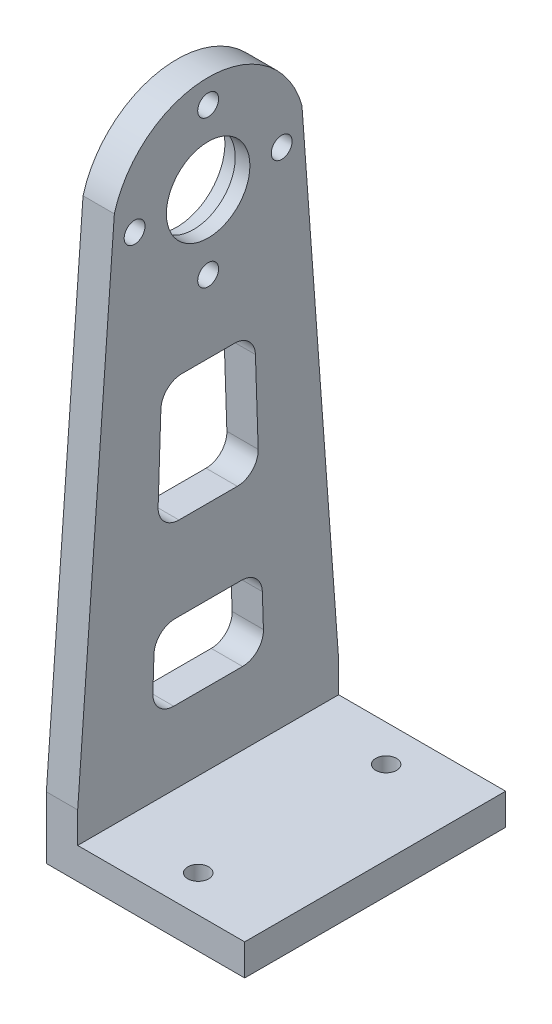
ISO-10303-21;
HEADER;
FILE_DESCRIPTION(('STEP AP214'),'2;1');
FILE_NAME('part.step','',(''),(''),'','','');
FILE_SCHEMA(('AUTOMOTIVE_DESIGN { 1 0 10303 214 1 1 1 1 }'));
ENDSEC;
DATA;
#1=APPLICATION_CONTEXT('core data for automotive mechanical design processes');
#2=APPLICATION_PROTOCOL_DEFINITION('international standard','automotive_design',2000,#1);
#3=PRODUCT_CONTEXT('',#1,'mechanical');
#4=PRODUCT('Part','Part','',(#3));
#5=PRODUCT_RELATED_PRODUCT_CATEGORY('part','',(#4));
#6=PRODUCT_DEFINITION_FORMATION('','',#4);
#7=PRODUCT_DEFINITION_CONTEXT('part definition',#1,'design');
#8=PRODUCT_DEFINITION('design','',#6,#7);
#9=PRODUCT_DEFINITION_SHAPE('','',#8);
#10=(LENGTH_UNIT() NAMED_UNIT(*) SI_UNIT(.MILLI.,.METRE.));
#11=(NAMED_UNIT(*) PLANE_ANGLE_UNIT() SI_UNIT($,.RADIAN.));
#12=(NAMED_UNIT(*) SI_UNIT($,.STERADIAN.) SOLID_ANGLE_UNIT());
#13=UNCERTAINTY_MEASURE_WITH_UNIT(LENGTH_MEASURE(1.E-05),#10,'distance_accuracy_value','');
#14=(GEOMETRIC_REPRESENTATION_CONTEXT(3) GLOBAL_UNCERTAINTY_ASSIGNED_CONTEXT((#13)) GLOBAL_UNIT_ASSIGNED_CONTEXT((#10,
#11,#12)) REPRESENTATION_CONTEXT('',''));
#15=CARTESIAN_POINT('',(0.,0.,0.));
#16=DIRECTION('',(0.,0.,1.));
#17=DIRECTION('',(1.,0.,0.));
#18=AXIS2_PLACEMENT_3D('',#15,#16,#17);
#19=CARTESIAN_POINT('',(15.5,-52.,0.));
#20=DIRECTION('',(-1.,0.,0.));
#21=DIRECTION('',(0.,0.,1.));
#22=AXIS2_PLACEMENT_3D('',#19,#20,#21);
#23=CYLINDRICAL_SURFACE('',#22,4.);
#24=CARTESIAN_POINT('',(16.5,-52.,0.));
#25=DIRECTION('',(-1.,0.,0.));
#26=DIRECTION('',(0.,0.,-1.));
#27=AXIS2_PLACEMENT_3D('',#24,#25,#26);
#28=CIRCLE('',#27,4.);
#29=CARTESIAN_POINT('',(16.5,-52.,-4.));
#30=VERTEX_POINT('',#29);
#31=EDGE_CURVE('E47',#30,#30,#28,.T.);
#32=ORIENTED_EDGE('',*,*,#31,.F.);
#33=EDGE_LOOP('',(#32));
#34=FACE_BOUND('',#33,.T.);
#35=CARTESIAN_POINT('',(15.1,-52.,0.));
#36=DIRECTION('',(-1.,0.,0.));
#37=DIRECTION('',(0.,0.,1.));
#38=AXIS2_PLACEMENT_3D('',#35,#36,#37);
#39=CIRCLE('',#38,4.);
#40=CARTESIAN_POINT('',(15.1,-52.,4.));
#41=VERTEX_POINT('',#40);
#42=EDGE_CURVE('E41',#41,#41,#39,.F.);
#43=ORIENTED_EDGE('',*,*,#42,.F.);
#44=EDGE_LOOP('',(#43));
#45=FACE_BOUND('',#44,.T.);
#46=ADVANCED_FACE('F38',(#34,#45),#23,.F.);
#47=CARTESIAN_POINT('',(16.5,-100.7,-12.5));
#48=DIRECTION('',(1.,0.,0.));
#49=DIRECTION('',(0.,-1.,0.));
#50=AXIS2_PLACEMENT_3D('',#47,#48,#49);
#51=PLANE('',#50);
#52=CARTESIAN_POINT('',(16.5,-59.0452123011725,1.54223501579341E-13));
#53=DIRECTION('',(-1.,0.,0.));
#54=DIRECTION('',(0.,0.,1.));
#55=AXIS2_PLACEMENT_3D('',#52,#53,#54);
#56=CIRCLE('',#55,1.);
#57=CARTESIAN_POINT('',(16.5,-59.0452123011725,1.00000000000015));
#58=VERTEX_POINT('',#57);
#59=EDGE_CURVE('E520',#58,#58,#56,.T.);
#60=ORIENTED_EDGE('',*,*,#59,.T.);
#61=EDGE_LOOP('',(#60));
#62=FACE_BOUND('',#61,.T.);
#63=CARTESIAN_POINT('',(16.5,-52.,7.04521230117253));
#64=DIRECTION('',(-1.,0.,0.));
#65=DIRECTION('',(0.,0.,1.));
#66=AXIS2_PLACEMENT_3D('',#63,#64,#65);
#67=CIRCLE('',#66,1.00000000000001);
#68=CARTESIAN_POINT('',(16.5,-52.,8.04521230117253));
#69=VERTEX_POINT('',#68);
#70=EDGE_CURVE('E526',#69,#69,#67,.T.);
#71=ORIENTED_EDGE('',*,*,#70,.T.);
#72=EDGE_LOOP('',(#71));
#73=FACE_BOUND('',#72,.T.);
#74=CARTESIAN_POINT('',(16.5,-52.0000000000001,-7.04521230117231));
#75=DIRECTION('',(-1.,0.,0.));
#76=DIRECTION('',(0.,0.,1.));
#77=AXIS2_PLACEMENT_3D('',#74,#75,#76);
#78=CIRCLE('',#77,1.);
#79=CARTESIAN_POINT('',(16.5,-52.0000000000001,-6.04521230117231));
#80=VERTEX_POINT('',#79);
#81=EDGE_CURVE('E532',#80,#80,#78,.T.);
#82=ORIENTED_EDGE('',*,*,#81,.T.);
#83=EDGE_LOOP('',(#82));
#84=FACE_BOUND('',#83,.T.);
#85=CARTESIAN_POINT('',(16.5,-44.9547876988277,0.));
#86=DIRECTION('',(-1.,0.,0.));
#87=DIRECTION('',(0.,0.,1.));
#88=AXIS2_PLACEMENT_3D('',#85,#86,#87);
#89=CIRCLE('',#88,1.);
#90=CARTESIAN_POINT('',(16.5,-44.9547876988277,1.00000000000001));
#91=VERTEX_POINT('',#90);
#92=EDGE_CURVE('E197',#91,#91,#89,.T.);
#93=ORIENTED_EDGE('',*,*,#92,.T.);
#94=EDGE_LOOP('',(#93));
#95=FACE_BOUND('',#94,.T.);
#96=DIRECTION('',(0.,-0.997297605701587,-0.0734675823876265));
#97=VECTOR('',#96,1.);
#98=CARTESIAN_POINT('',(16.5,-100.681108800183,-12.7564416540415));
#99=LINE('',#98,#97);
#100=CARTESIAN_POINT('',(16.5,-49.5,-8.986100377806));
#101=VERTEX_POINT('',#100);
#102=CARTESIAN_POINT('',(16.5,-97.2,-12.5));
#103=VERTEX_POINT('',#102);
#104=EDGE_CURVE('E172',#101,#103,#99,.T.);
#105=ORIENTED_EDGE('',*,*,#104,.F.);
#106=CARTESIAN_POINT('',(16.5,-52.0000000000001,0.));
#107=DIRECTION('',(1.,0.,0.));
#108=DIRECTION('',(0.,0.,-1.));
#109=AXIS2_PLACEMENT_3D('',#106,#107,#108);
#110=CIRCLE('',#109,9.32737905308911);
#111=CARTESIAN_POINT('',(16.5,-49.5,8.986100377806));
#112=VERTEX_POINT('',#111);
#113=EDGE_CURVE('E187',#101,#112,#110,.T.);
#114=ORIENTED_EDGE('',*,*,#113,.T.);
#115=DIRECTION('',(0.,0.997297605701587,-0.0734675823876265));
#116=VECTOR('',#115,1.);
#117=CARTESIAN_POINT('',(16.5,-98.8493826998868,12.6215045124945));
#118=LINE('',#117,#116);
#119=CARTESIAN_POINT('',(16.5,-97.2,12.5));
#120=VERTEX_POINT('',#119);
#121=EDGE_CURVE('E192',#120,#112,#118,.T.);
#122=ORIENTED_EDGE('',*,*,#121,.F.);
#123=DIRECTION('',(0.,1.,0.));
#124=VECTOR('',#123,1.);
#125=CARTESIAN_POINT('',(16.5,-100.7,12.5));
#126=LINE('',#125,#124);
#127=CARTESIAN_POINT('',(16.5,-100.149489742783,12.5));
#128=VERTEX_POINT('',#127);
#129=EDGE_CURVE('E152',#128,#120,#126,.T.);
#130=ORIENTED_EDGE('',*,*,#129,.F.);
#131=DIRECTION('',(0.,0.,1.));
#132=VECTOR('',#131,1.);
#133=CARTESIAN_POINT('',(16.5,-100.149489742783,12.5));
#134=LINE('',#133,#132);
#135=CARTESIAN_POINT('',(16.5,-100.149489742783,-12.5));
#136=VERTEX_POINT('',#135);
#137=EDGE_CURVE('E191',#136,#128,#134,.T.);
#138=ORIENTED_EDGE('',*,*,#137,.F.);
#139=DIRECTION('',(0.,1.,0.));
#140=VECTOR('',#139,1.);
#141=CARTESIAN_POINT('',(16.5,-100.7,-12.5));
#142=LINE('',#141,#140);
#143=EDGE_CURVE('E11',#136,#103,#142,.T.);
#144=ORIENTED_EDGE('',*,*,#143,.T.);
#145=EDGE_LOOP('',(#105,#114,#122,#130,#138,#144));
#146=FACE_BOUND('',#145,.T.);
#147=ORIENTED_EDGE('',*,*,#31,.T.);
#148=EDGE_LOOP('',(#147));
#149=FACE_BOUND('',#148,.T.);
#150=CARTESIAN_POINT('',(16.5,-91.2,-3.296767463509));
#151=DIRECTION('',(-1.,0.,0.));
#152=DIRECTION('',(0.,0.0330349000935773,-0.999454198738395));
#153=AXIS2_PLACEMENT_3D('',#150,#151,#152);
#154=CIRCLE('',#153,2.);
#155=CARTESIAN_POINT('',(16.5,-91.13393019981,-5.295675860986));
#156=VERTEX_POINT('',#155);
#157=CARTESIAN_POINT('',(16.5,-93.2,-3.296767463509));
#158=VERTEX_POINT('',#157);
#159=EDGE_CURVE('E259',#156,#158,#154,.T.);
#160=ORIENTED_EDGE('',*,*,#159,.T.);
#161=DIRECTION('',(0.,0.,-1.));
#162=VECTOR('',#161,1.);
#163=CARTESIAN_POINT('',(16.5,-93.2,3.296767463509));
#164=LINE('',#163,#162);
#165=CARTESIAN_POINT('',(16.5,-93.2,3.296767463509));
#166=VERTEX_POINT('',#165);
#167=EDGE_CURVE('E134',#166,#158,#164,.T.);
#168=ORIENTED_EDGE('',*,*,#167,.F.);
#169=CARTESIAN_POINT('',(16.5,-91.2,3.296767463509));
#170=DIRECTION('',(-1.,0.,0.));
#171=DIRECTION('',(0.,-1.,0.));
#172=AXIS2_PLACEMENT_3D('',#169,#170,#171);
#173=CIRCLE('',#172,2.);
#174=CARTESIAN_POINT('',(16.5,-91.13393019981,5.295675860986));
#175=VERTEX_POINT('',#174);
#176=EDGE_CURVE('E265',#166,#175,#173,.T.);
#177=ORIENTED_EDGE('',*,*,#176,.T.);
#178=DIRECTION('',(0.,-0.999454198738395,0.0330349000935798));
#179=VECTOR('',#178,1.);
#180=CARTESIAN_POINT('',(16.5,-87.93393019981,5.189906451609));
#181=LINE('',#180,#179);
#182=CARTESIAN_POINT('',(16.5,-87.93393019981,5.189906451609));
#183=VERTEX_POINT('',#182);
#184=EDGE_CURVE('E145',#183,#175,#181,.T.);
#185=ORIENTED_EDGE('',*,*,#184,.F.);
#186=CARTESIAN_POINT('',(16.5,-88.,3.190998054133));
#187=DIRECTION('',(-1.,0.,0.));
#188=DIRECTION('',(0.,0.0330349000935773,0.999454198738395));
#189=AXIS2_PLACEMENT_3D('',#186,#187,#188);
#190=CIRCLE('',#189,2.);
#191=CARTESIAN_POINT('',(16.5,-86.,3.190998054133));
#192=VERTEX_POINT('',#191);
#193=EDGE_CURVE('E126',#183,#192,#190,.T.);
#194=ORIENTED_EDGE('',*,*,#193,.T.);
#195=DIRECTION('',(0.,0.,1.));
#196=VECTOR('',#195,1.);
#197=CARTESIAN_POINT('',(16.5,-86.,-3.190998054133));
#198=LINE('',#197,#196);
#199=CARTESIAN_POINT('',(16.5,-86.,-3.190998054133));
#200=VERTEX_POINT('',#199);
#201=EDGE_CURVE('E101',#200,#192,#198,.T.);
#202=ORIENTED_EDGE('',*,*,#201,.F.);
#203=CARTESIAN_POINT('',(16.5,-88.,-3.190998054133));
#204=DIRECTION('',(-1.,0.,0.));
#205=DIRECTION('',(0.,1.,0.));
#206=AXIS2_PLACEMENT_3D('',#203,#204,#205);
#207=CIRCLE('',#206,2.);
#208=CARTESIAN_POINT('',(16.5,-87.93393019981,-5.189906451609));
#209=VERTEX_POINT('',#208);
#210=EDGE_CURVE('E120',#200,#209,#207,.T.);
#211=ORIENTED_EDGE('',*,*,#210,.T.);
#212=DIRECTION('',(0.,0.999454198738395,0.0330349000935798));
#213=VECTOR('',#212,1.);
#214=CARTESIAN_POINT('',(16.5,-91.13393019981,-5.295675860986));
#215=LINE('',#214,#213);
#216=EDGE_CURVE('E107',#156,#209,#215,.T.);
#217=ORIENTED_EDGE('',*,*,#216,.F.);
#218=EDGE_LOOP('',(#160,#168,#177,#185,#194,#202,#211,#217));
#219=FACE_BOUND('',#218,.T.);
#220=CARTESIAN_POINT('',(16.5,-68.,-2.529939245529));
#221=DIRECTION('',(-1.,0.,0.));
#222=DIRECTION('',(0.,1.,0.));
#223=AXIS2_PLACEMENT_3D('',#220,#221,#222);
#224=CIRCLE('',#223,2.);
#225=CARTESIAN_POINT('',(16.5,-66.,-2.529939245529));
#226=VERTEX_POINT('',#225);
#227=CARTESIAN_POINT('',(16.5,-67.93393019981,-4.528847643006));
#228=VERTEX_POINT('',#227);
#229=EDGE_CURVE('E239',#226,#228,#224,.T.);
#230=ORIENTED_EDGE('',*,*,#229,.T.);
#231=DIRECTION('',(0.,0.999454198738395,0.0330349000935798));
#232=VECTOR('',#231,1.);
#233=CARTESIAN_POINT('',(16.5,-75.93393019981,-4.793271166447));
#234=LINE('',#233,#232);
#235=CARTESIAN_POINT('',(16.5,-75.93393019981,-4.793271166447));
#236=VERTEX_POINT('',#235);
#237=EDGE_CURVE('E56',#236,#228,#234,.T.);
#238=ORIENTED_EDGE('',*,*,#237,.F.);
#239=CARTESIAN_POINT('',(16.5,-76.,-2.794362768971));
#240=DIRECTION('',(-1.,0.,0.));
#241=DIRECTION('',(0.,0.0330349000935773,-0.999454198738395));
#242=AXIS2_PLACEMENT_3D('',#239,#240,#241);
#243=CIRCLE('',#242,2.);
#244=CARTESIAN_POINT('',(16.5,-78.,-2.794362768971));
#245=VERTEX_POINT('',#244);
#246=EDGE_CURVE('E241',#236,#245,#243,.T.);
#247=ORIENTED_EDGE('',*,*,#246,.T.);
#248=DIRECTION('',(0.,0.,-1.));
#249=VECTOR('',#248,1.);
#250=CARTESIAN_POINT('',(16.5,-78.,2.794362768971));
#251=LINE('',#250,#249);
#252=CARTESIAN_POINT('',(16.5,-78.,2.794362768971));
#253=VERTEX_POINT('',#252);
#254=EDGE_CURVE('E248',#253,#245,#251,.T.);
#255=ORIENTED_EDGE('',*,*,#254,.F.);
#256=CARTESIAN_POINT('',(16.5,-76.,2.794362768971));
#257=DIRECTION('',(-1.,0.,0.));
#258=DIRECTION('',(0.,-1.,0.));
#259=AXIS2_PLACEMENT_3D('',#256,#257,#258);
#260=CIRCLE('',#259,2.);
#261=CARTESIAN_POINT('',(16.5,-75.93393019981,4.793271166447));
#262=VERTEX_POINT('',#261);
#263=EDGE_CURVE('E247',#253,#262,#260,.T.);
#264=ORIENTED_EDGE('',*,*,#263,.T.);
#265=DIRECTION('',(0.,-0.999454198738395,0.0330349000935798));
#266=VECTOR('',#265,1.);
#267=CARTESIAN_POINT('',(16.5,-67.93393019981,4.528847643006));
#268=LINE('',#267,#266);
#269=CARTESIAN_POINT('',(16.5,-67.93393019981,4.528847643006));
#270=VERTEX_POINT('',#269);
#271=EDGE_CURVE('E127',#270,#262,#268,.T.);
#272=ORIENTED_EDGE('',*,*,#271,.F.);
#273=CARTESIAN_POINT('',(16.5,-68.,2.529939245529));
#274=DIRECTION('',(-1.,0.,0.));
#275=DIRECTION('',(0.,0.0330349000935773,0.999454198738395));
#276=AXIS2_PLACEMENT_3D('',#273,#274,#275);
#277=CIRCLE('',#276,2.);
#278=CARTESIAN_POINT('',(16.5,-66.,2.529939245529));
#279=VERTEX_POINT('',#278);
#280=EDGE_CURVE('E254',#270,#279,#277,.T.);
#281=ORIENTED_EDGE('',*,*,#280,.T.);
#282=DIRECTION('',(0.,0.,1.));
#283=VECTOR('',#282,1.);
#284=CARTESIAN_POINT('',(16.5,-66.,-2.529939245529));
#285=LINE('',#284,#283);
#286=EDGE_CURVE('E260',#226,#279,#285,.T.);
#287=ORIENTED_EDGE('',*,*,#286,.F.);
#288=EDGE_LOOP('',(#230,#238,#247,#255,#264,#272,#281,#287));
#289=FACE_BOUND('',#288,.T.);
#290=ADVANCED_FACE('F121',(#62,#73,#84,#95,#146,#149,#219,#289),#51,.T.);
#291=CARTESIAN_POINT('',(15.5,-70.85,12.5));
#292=DIRECTION('',(0.,0.,-1.));
#293=DIRECTION('',(0.,-1.,0.));
#294=AXIS2_PLACEMENT_3D('',#291,#292,#293);
#295=PLANE('',#294);
#296=DIRECTION('',(-1.,0.,0.));
#297=VECTOR('',#296,1.);
#298=CARTESIAN_POINT('',(32.5,-100.149489742783,12.5));
#299=LINE('',#298,#297);
#300=CARTESIAN_POINT('',(32.5,-100.149489742783,12.5));
#301=VERTEX_POINT('',#300);
#302=EDGE_CURVE('E222',#301,#128,#299,.T.);
#303=ORIENTED_EDGE('',*,*,#302,.T.);
#304=ORIENTED_EDGE('',*,*,#129,.T.);
#305=DIRECTION('',(-1.,0.,0.));
#306=VECTOR('',#305,1.);
#307=CARTESIAN_POINT('',(16.5,-97.2,12.5));
#308=LINE('',#307,#306);
#309=CARTESIAN_POINT('',(13.5,-97.2,12.5));
#310=VERTEX_POINT('',#309);
#311=EDGE_CURVE('E158',#120,#310,#308,.T.);
#312=ORIENTED_EDGE('',*,*,#311,.T.);
#313=DIRECTION('',(0.,-1.,0.));
#314=VECTOR('',#313,1.);
#315=CARTESIAN_POINT('',(13.5,0.,12.5));
#316=LINE('',#315,#314);
#317=CARTESIAN_POINT('',(13.5,-103.149489742783,12.5));
#318=VERTEX_POINT('',#317);
#319=EDGE_CURVE('E384',#310,#318,#316,.T.);
#320=ORIENTED_EDGE('',*,*,#319,.T.);
#321=DIRECTION('',(-1.,0.,0.));
#322=VECTOR('',#321,1.);
#323=CARTESIAN_POINT('',(75.6884089130718,-103.149489742783,12.5));
#324=LINE('',#323,#322);
#325=CARTESIAN_POINT('',(32.5,-103.149489742783,12.5));
#326=VERTEX_POINT('',#325);
#327=EDGE_CURVE('E230',#326,#318,#324,.T.);
#328=ORIENTED_EDGE('',*,*,#327,.F.);
#329=DIRECTION('',(0.,-1.,0.));
#330=VECTOR('',#329,1.);
#331=CARTESIAN_POINT('',(32.5,-103.149489742783,12.5));
#332=LINE('',#331,#330);
#333=EDGE_CURVE('E210',#301,#326,#332,.T.);
#334=ORIENTED_EDGE('',*,*,#333,.F.);
#335=EDGE_LOOP('',(#303,#304,#312,#320,#328,#334));
#336=FACE_BOUND('',#335,.T.);
#337=ADVANCED_FACE('F375',(#336),#295,.F.);
#338=CARTESIAN_POINT('',(15.93933982822,-101.76066017178,-12.5));
#339=DIRECTION('',(0.,0.,-1.));
#340=DIRECTION('',(1.,0.,0.));
#341=AXIS2_PLACEMENT_3D('',#338,#339,#340);
#342=PLANE('',#341);
#343=DIRECTION('',(-1.,0.,0.));
#344=VECTOR('',#343,1.);
#345=CARTESIAN_POINT('',(75.6884089130718,-103.149489742783,-12.5));
#346=LINE('',#345,#344);
#347=CARTESIAN_POINT('',(32.5,-103.149489742783,-12.5));
#348=VERTEX_POINT('',#347);
#349=CARTESIAN_POINT('',(13.5,-103.149489742783,-12.5));
#350=VERTEX_POINT('',#349);
#351=EDGE_CURVE('E157',#348,#350,#346,.T.);
#352=ORIENTED_EDGE('',*,*,#351,.T.);
#353=DIRECTION('',(0.,1.,0.));
#354=VECTOR('',#353,1.);
#355=CARTESIAN_POINT('',(13.5,0.,-12.5));
#356=LINE('',#355,#354);
#357=CARTESIAN_POINT('',(13.5,-97.2,-12.5));
#358=VERTEX_POINT('',#357);
#359=EDGE_CURVE('E392',#350,#358,#356,.T.);
#360=ORIENTED_EDGE('',*,*,#359,.T.);
#361=DIRECTION('',(-1.,0.,0.));
#362=VECTOR('',#361,1.);
#363=CARTESIAN_POINT('',(16.5,-97.2,-12.5));
#364=LINE('',#363,#362);
#365=EDGE_CURVE('E161',#103,#358,#364,.T.);
#366=ORIENTED_EDGE('',*,*,#365,.F.);
#367=ORIENTED_EDGE('',*,*,#143,.F.);
#368=DIRECTION('',(-1.,0.,0.));
#369=VECTOR('',#368,1.);
#370=CARTESIAN_POINT('',(32.5,-100.149489742783,-12.5));
#371=LINE('',#370,#369);
#372=CARTESIAN_POINT('',(32.5,-100.149489742783,-12.5));
#373=VERTEX_POINT('',#372);
#374=EDGE_CURVE('E227',#373,#136,#371,.T.);
#375=ORIENTED_EDGE('',*,*,#374,.F.);
#376=DIRECTION('',(0.,1.,0.));
#377=VECTOR('',#376,1.);
#378=CARTESIAN_POINT('',(32.5,-100.149489742783,-12.5));
#379=LINE('',#378,#377);
#380=EDGE_CURVE('E216',#348,#373,#379,.T.);
#381=ORIENTED_EDGE('',*,*,#380,.F.);
#382=EDGE_LOOP('',(#352,#360,#366,#367,#375,#381));
#383=FACE_BOUND('',#382,.T.);
#384=ADVANCED_FACE('F477',(#383),#342,.T.);
#385=CARTESIAN_POINT('',(15.5,-72.,4.663243205897));
#386=DIRECTION('',(0.,0.0330349000935798,0.999454198738395));
#387=DIRECTION('',(0.,0.999454198738395,-0.0330349000935798));
#388=AXIS2_PLACEMENT_3D('',#385,#386,#387);
#389=PLANE('',#388);
#390=ORIENTED_EDGE('',*,*,#271,.T.);
#391=DIRECTION('',(-1.,0.,0.));
#392=VECTOR('',#391,1.);
#393=CARTESIAN_POINT('',(16.5,-75.93393019981,4.793271166447));
#394=LINE('',#393,#392);
#395=CARTESIAN_POINT('',(13.5,-75.93393019981,4.79327116644733));
#396=VERTEX_POINT('',#395);
#397=EDGE_CURVE('E256',#262,#396,#394,.T.);
#398=ORIENTED_EDGE('',*,*,#397,.T.);
#399=DIRECTION('',(0.,0.999454198738395,-0.0330349000935798));
#400=VECTOR('',#399,1.);
#401=CARTESIAN_POINT('',(13.5,0.0753917599162948,2.28093957557516));
#402=LINE('',#401,#400);
#403=CARTESIAN_POINT('',(13.5,-67.93393019981,4.5288476430057));
#404=VERTEX_POINT('',#403);
#405=EDGE_CURVE('E327',#396,#404,#402,.T.);
#406=ORIENTED_EDGE('',*,*,#405,.T.);
#407=DIRECTION('',(-1.,0.,0.));
#408=VECTOR('',#407,1.);
#409=CARTESIAN_POINT('',(16.5,-67.93393019981,4.528847643006));
#410=LINE('',#409,#408);
#411=EDGE_CURVE('E262',#270,#404,#410,.T.);
#412=ORIENTED_EDGE('',*,*,#411,.F.);
#413=EDGE_LOOP('',(#390,#398,#406,#412));
#414=FACE_BOUND('',#413,.T.);
#415=ADVANCED_FACE('F475',(#414),#389,.F.);
#416=CARTESIAN_POINT('',(118.162,-68.,2.529939245529));
#417=DIRECTION('',(-1.,0.,0.));
#418=DIRECTION('',(0.,-0.0330349000935773,-0.999454198738395));
#419=AXIS2_PLACEMENT_3D('',#416,#417,#418);
#420=CYLINDRICAL_SURFACE('',#419,2.);
#421=ORIENTED_EDGE('',*,*,#411,.T.);
#422=CARTESIAN_POINT('',(13.5,-68.,2.529939245529));
#423=DIRECTION('',(1.,0.,0.));
#424=DIRECTION('',(0.,0.,-1.));
#425=AXIS2_PLACEMENT_3D('',#422,#423,#424);
#426=CIRCLE('',#425,2.);
#427=CARTESIAN_POINT('',(13.5,-66.,2.529939245529));
#428=VERTEX_POINT('',#427);
#429=EDGE_CURVE('E206',#404,#428,#426,.F.);
#430=ORIENTED_EDGE('',*,*,#429,.T.);
#431=DIRECTION('',(-1.,0.,0.));
#432=VECTOR('',#431,1.);
#433=CARTESIAN_POINT('',(16.5,-66.,2.529939245529));
#434=LINE('',#433,#432);
#435=EDGE_CURVE('E263',#279,#428,#434,.T.);
#436=ORIENTED_EDGE('',*,*,#435,.F.);
#437=ORIENTED_EDGE('',*,*,#280,.F.);
#438=EDGE_LOOP('',(#421,#430,#436,#437));
#439=FACE_BOUND('',#438,.T.);
#440=ADVANCED_FACE('F338',(#439),#420,.F.);
#441=CARTESIAN_POINT('',(15.5,-66.,0.));
#442=DIRECTION('',(0.,1.,0.));
#443=DIRECTION('',(0.,0.,-1.));
#444=AXIS2_PLACEMENT_3D('',#441,#442,#443);
#445=PLANE('',#444);
#446=ORIENTED_EDGE('',*,*,#286,.T.);
#447=ORIENTED_EDGE('',*,*,#435,.T.);
#448=DIRECTION('',(0.,0.,-1.));
#449=VECTOR('',#448,1.);
#450=CARTESIAN_POINT('',(13.5,-66.,0.));
#451=LINE('',#450,#449);
#452=CARTESIAN_POINT('',(13.5,-66.,-2.529939245529));
#453=VERTEX_POINT('',#452);
#454=EDGE_CURVE('E307',#428,#453,#451,.T.);
#455=ORIENTED_EDGE('',*,*,#454,.T.);
#456=DIRECTION('',(-1.,0.,0.));
#457=VECTOR('',#456,1.);
#458=CARTESIAN_POINT('',(16.5,-66.,-2.529939245529));
#459=LINE('',#458,#457);
#460=EDGE_CURVE('E243',#226,#453,#459,.T.);
#461=ORIENTED_EDGE('',*,*,#460,.F.);
#462=EDGE_LOOP('',(#446,#447,#455,#461));
#463=FACE_BOUND('',#462,.T.);
#464=ADVANCED_FACE('F473',(#463),#445,.F.);
#465=CARTESIAN_POINT('',(118.162,-68.,-2.529939245529));
#466=DIRECTION('',(-1.,0.,0.));
#467=DIRECTION('',(0.,-1.,0.));
#468=AXIS2_PLACEMENT_3D('',#465,#466,#467);
#469=CYLINDRICAL_SURFACE('',#468,2.);
#470=ORIENTED_EDGE('',*,*,#460,.T.);
#471=CARTESIAN_POINT('',(13.5,-68.,-2.529939245529));
#472=DIRECTION('',(1.,0.,0.));
#473=DIRECTION('',(0.,0.,-1.));
#474=AXIS2_PLACEMENT_3D('',#471,#472,#473);
#475=CIRCLE('',#474,2.);
#476=CARTESIAN_POINT('',(13.5,-67.93393019981,-4.52884764300567));
#477=VERTEX_POINT('',#476);
#478=EDGE_CURVE('E310',#453,#477,#475,.F.);
#479=ORIENTED_EDGE('',*,*,#478,.T.);
#480=DIRECTION('',(-1.,0.,0.));
#481=VECTOR('',#480,1.);
#482=CARTESIAN_POINT('',(16.5,-67.93393019981,-4.528847643006));
#483=LINE('',#482,#481);
#484=EDGE_CURVE('E244',#228,#477,#483,.T.);
#485=ORIENTED_EDGE('',*,*,#484,.F.);
#486=ORIENTED_EDGE('',*,*,#229,.F.);
#487=EDGE_LOOP('',(#470,#479,#485,#486));
#488=FACE_BOUND('',#487,.T.);
#489=ADVANCED_FACE('F470',(#488),#469,.F.);
#490=CARTESIAN_POINT('',(15.5,-72.,-4.663243205897));
#491=DIRECTION('',(0.,0.0330349000935798,-0.999454198738395));
#492=DIRECTION('',(0.,-0.999454198738395,-0.0330349000935798));
#493=AXIS2_PLACEMENT_3D('',#490,#491,#492);
#494=PLANE('',#493);
#495=ORIENTED_EDGE('',*,*,#484,.T.);
#496=DIRECTION('',(0.,-0.999454198738395,-0.0330349000935798));
#497=VECTOR('',#496,1.);
#498=CARTESIAN_POINT('',(13.5,0.0753917599162838,-2.28093957557483));
#499=LINE('',#498,#497);
#500=CARTESIAN_POINT('',(13.5,-75.9339301998128,-4.79327116644779));
#501=VERTEX_POINT('',#500);
#502=EDGE_CURVE('E316',#477,#501,#499,.T.);
#503=ORIENTED_EDGE('',*,*,#502,.T.);
#504=DIRECTION('',(-1.,0.,0.));
#505=VECTOR('',#504,1.);
#506=CARTESIAN_POINT('',(16.5,-75.93393019981,-4.793271166447));
#507=LINE('',#506,#505);
#508=EDGE_CURVE('E250',#236,#501,#507,.T.);
#509=ORIENTED_EDGE('',*,*,#508,.F.);
#510=ORIENTED_EDGE('',*,*,#237,.T.);
#511=EDGE_LOOP('',(#495,#503,#509,#510));
#512=FACE_BOUND('',#511,.T.);
#513=ADVANCED_FACE('F466',(#512),#494,.F.);
#514=CARTESIAN_POINT('',(118.162,-76.,-2.794362768971));
#515=DIRECTION('',(-1.,0.,0.));
#516=DIRECTION('',(0.,-0.0330349000935773,0.999454198738395));
#517=AXIS2_PLACEMENT_3D('',#514,#515,#516);
#518=CYLINDRICAL_SURFACE('',#517,2.);
#519=ORIENTED_EDGE('',*,*,#508,.T.);
#520=CARTESIAN_POINT('',(13.5,-76.,-2.794362768971));
#521=DIRECTION('',(1.,0.,0.));
#522=DIRECTION('',(0.,0.,-1.));
#523=AXIS2_PLACEMENT_3D('',#520,#521,#522);
#524=CIRCLE('',#523,2.);
#525=CARTESIAN_POINT('',(13.5,-78.,-2.794362768971));
#526=VERTEX_POINT('',#525);
#527=EDGE_CURVE('E319',#501,#526,#524,.F.);
#528=ORIENTED_EDGE('',*,*,#527,.T.);
#529=DIRECTION('',(-1.,0.,0.));
#530=VECTOR('',#529,1.);
#531=CARTESIAN_POINT('',(16.5,-78.,-2.794362768971));
#532=LINE('',#531,#530);
#533=EDGE_CURVE('E251',#245,#526,#532,.T.);
#534=ORIENTED_EDGE('',*,*,#533,.F.);
#535=ORIENTED_EDGE('',*,*,#246,.F.);
#536=EDGE_LOOP('',(#519,#528,#534,#535));
#537=FACE_BOUND('',#536,.T.);
#538=ADVANCED_FACE('F464',(#537),#518,.F.);
#539=CARTESIAN_POINT('',(15.5,-78.,0.));
#540=DIRECTION('',(0.,-1.,0.));
#541=DIRECTION('',(0.,0.,1.));
#542=AXIS2_PLACEMENT_3D('',#539,#540,#541);
#543=PLANE('',#542);
#544=ORIENTED_EDGE('',*,*,#254,.T.);
#545=ORIENTED_EDGE('',*,*,#533,.T.);
#546=DIRECTION('',(0.,0.,1.));
#547=VECTOR('',#546,1.);
#548=CARTESIAN_POINT('',(13.5,-78.,0.));
#549=LINE('',#548,#547);
#550=CARTESIAN_POINT('',(13.5,-78.,2.794362768971));
#551=VERTEX_POINT('',#550);
#552=EDGE_CURVE('E322',#526,#551,#549,.T.);
#553=ORIENTED_EDGE('',*,*,#552,.T.);
#554=DIRECTION('',(-1.,0.,0.));
#555=VECTOR('',#554,1.);
#556=CARTESIAN_POINT('',(16.5,-78.,2.794362768971));
#557=LINE('',#556,#555);
#558=EDGE_CURVE('E271',#253,#551,#557,.T.);
#559=ORIENTED_EDGE('',*,*,#558,.F.);
#560=EDGE_LOOP('',(#544,#545,#553,#559));
#561=FACE_BOUND('',#560,.T.);
#562=ADVANCED_FACE('F460',(#561),#543,.F.);
#563=CARTESIAN_POINT('',(118.162,-76.,2.794362768971));
#564=DIRECTION('',(-1.,0.,0.));
#565=DIRECTION('',(0.,1.,0.));
#566=AXIS2_PLACEMENT_3D('',#563,#564,#565);
#567=CYLINDRICAL_SURFACE('',#566,2.);
#568=ORIENTED_EDGE('',*,*,#558,.T.);
#569=CARTESIAN_POINT('',(13.5,-76.,2.794362768971));
#570=DIRECTION('',(1.,0.,0.));
#571=DIRECTION('',(0.,0.,-1.));
#572=AXIS2_PLACEMENT_3D('',#569,#570,#571);
#573=CIRCLE('',#572,2.);
#574=EDGE_CURVE('E325',#551,#396,#573,.F.);
#575=ORIENTED_EDGE('',*,*,#574,.T.);
#576=ORIENTED_EDGE('',*,*,#397,.F.);
#577=ORIENTED_EDGE('',*,*,#263,.F.);
#578=EDGE_LOOP('',(#568,#575,#576,#577));
#579=FACE_BOUND('',#578,.T.);
#580=ADVANCED_FACE('F455',(#579),#567,.F.);
#581=CARTESIAN_POINT('',(15.5,-86.,0.));
#582=DIRECTION('',(0.,1.,0.));
#583=DIRECTION('',(0.,0.,-1.));
#584=AXIS2_PLACEMENT_3D('',#581,#582,#583);
#585=PLANE('',#584);
#586=ORIENTED_EDGE('',*,*,#201,.T.);
#587=DIRECTION('',(-1.,0.,0.));
#588=VECTOR('',#587,1.);
#589=CARTESIAN_POINT('',(16.5,-86.,3.190998054133));
#590=LINE('',#589,#588);
#591=CARTESIAN_POINT('',(13.5,-86.,3.190998054133));
#592=VERTEX_POINT('',#591);
#593=EDGE_CURVE('E272',#192,#592,#590,.T.);
#594=ORIENTED_EDGE('',*,*,#593,.T.);
#595=DIRECTION('',(0.,0.,-1.));
#596=VECTOR('',#595,1.);
#597=CARTESIAN_POINT('',(13.5,-86.,0.));
#598=LINE('',#597,#596);
#599=CARTESIAN_POINT('',(13.5,-86.,-3.190998054133));
#600=VERTEX_POINT('',#599);
#601=EDGE_CURVE('E296',#592,#600,#598,.T.);
#602=ORIENTED_EDGE('',*,*,#601,.T.);
#603=DIRECTION('',(-1.,0.,0.));
#604=VECTOR('',#603,1.);
#605=CARTESIAN_POINT('',(16.5,-86.,-3.190998054133));
#606=LINE('',#605,#604);
#607=EDGE_CURVE('E118',#200,#600,#606,.T.);
#608=ORIENTED_EDGE('',*,*,#607,.F.);
#609=EDGE_LOOP('',(#586,#594,#602,#608));
#610=FACE_BOUND('',#609,.T.);
#611=ADVANCED_FACE('F297',(#610),#585,.F.);
#612=CARTESIAN_POINT('',(118.162,-88.,-3.190998054133));
#613=DIRECTION('',(-1.,0.,0.));
#614=DIRECTION('',(0.,-1.,0.));
#615=AXIS2_PLACEMENT_3D('',#612,#613,#614);
#616=CYLINDRICAL_SURFACE('',#615,2.);
#617=ORIENTED_EDGE('',*,*,#607,.T.);
#618=CARTESIAN_POINT('',(13.5,-88.,-3.190998054133));
#619=DIRECTION('',(1.,0.,0.));
#620=DIRECTION('',(0.,0.,-1.));
#621=AXIS2_PLACEMENT_3D('',#618,#619,#620);
#622=CIRCLE('',#621,2.);
#623=CARTESIAN_POINT('',(13.5,-87.93393019981,-5.18990645160947));
#624=VERTEX_POINT('',#623);
#625=EDGE_CURVE('E132',#600,#624,#622,.F.);
#626=ORIENTED_EDGE('',*,*,#625,.T.);
#627=DIRECTION('',(-1.,0.,0.));
#628=VECTOR('',#627,1.);
#629=CARTESIAN_POINT('',(16.5,-87.93393019981,-5.189906451609));
#630=LINE('',#629,#628);
#631=EDGE_CURVE('E112',#209,#624,#630,.T.);
#632=ORIENTED_EDGE('',*,*,#631,.F.);
#633=ORIENTED_EDGE('',*,*,#210,.F.);
#634=EDGE_LOOP('',(#617,#626,#632,#633));
#635=FACE_BOUND('',#634,.T.);
#636=ADVANCED_FACE('F130',(#635),#616,.F.);
#637=CARTESIAN_POINT('',(15.5,-89.6,-5.244974957468));
#638=DIRECTION('',(0.,0.0330349000935798,-0.999454198738395));
#639=DIRECTION('',(0.,-0.999454198738395,-0.0330349000935798));
#640=AXIS2_PLACEMENT_3D('',#637,#638,#639);
#641=PLANE('',#640);
#642=ORIENTED_EDGE('',*,*,#631,.T.);
#643=DIRECTION('',(0.,-0.999454198738395,-0.0330349000935798));
#644=VECTOR('',#643,1.);
#645=CARTESIAN_POINT('',(13.5,0.0753917599162994,-2.2809395755753));
#646=LINE('',#645,#644);
#647=CARTESIAN_POINT('',(13.5,-91.13393019981,-5.295675860986));
#648=VERTEX_POINT('',#647);
#649=EDGE_CURVE('E306',#624,#648,#646,.T.);
#650=ORIENTED_EDGE('',*,*,#649,.T.);
#651=DIRECTION('',(-1.,0.,0.));
#652=VECTOR('',#651,1.);
#653=CARTESIAN_POINT('',(16.5,-91.13393019981,-5.295675860986));
#654=LINE('',#653,#652);
#655=EDGE_CURVE('E115',#156,#648,#654,.T.);
#656=ORIENTED_EDGE('',*,*,#655,.F.);
#657=ORIENTED_EDGE('',*,*,#216,.T.);
#658=EDGE_LOOP('',(#642,#650,#656,#657));
#659=FACE_BOUND('',#658,.T.);
#660=ADVANCED_FACE('F108',(#659),#641,.F.);
#661=CARTESIAN_POINT('',(118.162,-91.2,-3.296767463509));
#662=DIRECTION('',(-1.,0.,0.));
#663=DIRECTION('',(0.,-0.0330349000935773,0.999454198738395));
#664=AXIS2_PLACEMENT_3D('',#661,#662,#663);
#665=CYLINDRICAL_SURFACE('',#664,2.);
#666=ORIENTED_EDGE('',*,*,#655,.T.);
#667=CARTESIAN_POINT('',(13.5,-91.2,-3.296767463509));
#668=DIRECTION('',(1.,0.,0.));
#669=DIRECTION('',(0.,0.,-1.));
#670=AXIS2_PLACEMENT_3D('',#667,#668,#669);
#671=CIRCLE('',#670,2.);
#672=CARTESIAN_POINT('',(13.5,-93.2,-3.296767463509));
#673=VERTEX_POINT('',#672);
#674=EDGE_CURVE('E400',#648,#673,#671,.F.);
#675=ORIENTED_EDGE('',*,*,#674,.T.);
#676=DIRECTION('',(-1.,0.,0.));
#677=VECTOR('',#676,1.);
#678=CARTESIAN_POINT('',(16.5,-93.2,-3.296767463509));
#679=LINE('',#678,#677);
#680=EDGE_CURVE('E139',#158,#673,#679,.T.);
#681=ORIENTED_EDGE('',*,*,#680,.F.);
#682=ORIENTED_EDGE('',*,*,#159,.F.);
#683=EDGE_LOOP('',(#666,#675,#681,#682));
#684=FACE_BOUND('',#683,.T.);
#685=ADVANCED_FACE('F439',(#684),#665,.F.);
#686=CARTESIAN_POINT('',(15.5,-93.2,0.));
#687=DIRECTION('',(0.,-1.,0.));
#688=DIRECTION('',(0.,0.,1.));
#689=AXIS2_PLACEMENT_3D('',#686,#687,#688);
#690=PLANE('',#689);
#691=ORIENTED_EDGE('',*,*,#167,.T.);
#692=ORIENTED_EDGE('',*,*,#680,.T.);
#693=DIRECTION('',(0.,0.,1.));
#694=VECTOR('',#693,1.);
#695=CARTESIAN_POINT('',(13.5,-93.2,0.));
#696=LINE('',#695,#694);
#697=CARTESIAN_POINT('',(13.5,-93.2,3.296767463509));
#698=VERTEX_POINT('',#697);
#699=EDGE_CURVE('E403',#673,#698,#696,.T.);
#700=ORIENTED_EDGE('',*,*,#699,.T.);
#701=DIRECTION('',(-1.,0.,0.));
#702=VECTOR('',#701,1.);
#703=CARTESIAN_POINT('',(16.5,-93.2,3.296767463509));
#704=LINE('',#703,#702);
#705=EDGE_CURVE('E142',#166,#698,#704,.T.);
#706=ORIENTED_EDGE('',*,*,#705,.F.);
#707=EDGE_LOOP('',(#691,#692,#700,#706));
#708=FACE_BOUND('',#707,.T.);
#709=ADVANCED_FACE('F434',(#708),#690,.F.);
#710=CARTESIAN_POINT('',(118.162,-91.2,3.296767463509));
#711=DIRECTION('',(-1.,0.,0.));
#712=DIRECTION('',(0.,1.,0.));
#713=AXIS2_PLACEMENT_3D('',#710,#711,#712);
#714=CYLINDRICAL_SURFACE('',#713,2.);
#715=ORIENTED_EDGE('',*,*,#705,.T.);
#716=CARTESIAN_POINT('',(13.5,-91.2,3.296767463509));
#717=DIRECTION('',(1.,0.,0.));
#718=DIRECTION('',(0.,0.,-1.));
#719=AXIS2_PLACEMENT_3D('',#716,#717,#718);
#720=CIRCLE('',#719,2.);
#721=CARTESIAN_POINT('',(13.5,-91.13393019981,5.29567586098553));
#722=VERTEX_POINT('',#721);
#723=EDGE_CURVE('E406',#698,#722,#720,.F.);
#724=ORIENTED_EDGE('',*,*,#723,.T.);
#725=DIRECTION('',(-1.,0.,0.));
#726=VECTOR('',#725,1.);
#727=CARTESIAN_POINT('',(16.5,-91.13393019981,5.295675860986));
#728=LINE('',#727,#726);
#729=EDGE_CURVE('E146',#175,#722,#728,.T.);
#730=ORIENTED_EDGE('',*,*,#729,.F.);
#731=ORIENTED_EDGE('',*,*,#176,.F.);
#732=EDGE_LOOP('',(#715,#724,#730,#731));
#733=FACE_BOUND('',#732,.T.);
#734=ADVANCED_FACE('F428',(#733),#714,.F.);
#735=CARTESIAN_POINT('',(15.5,-89.6,5.244974957468));
#736=DIRECTION('',(0.,0.0330349000935798,0.999454198738395));
#737=DIRECTION('',(0.,0.999454198738395,-0.0330349000935798));
#738=AXIS2_PLACEMENT_3D('',#735,#736,#737);
#739=PLANE('',#738);
#740=ORIENTED_EDGE('',*,*,#184,.T.);
#741=ORIENTED_EDGE('',*,*,#729,.T.);
#742=DIRECTION('',(0.,0.999454198738395,-0.0330349000935798));
#743=VECTOR('',#742,1.);
#744=CARTESIAN_POINT('',(13.5,0.075391759916284,2.28093957557484));
#745=LINE('',#744,#743);
#746=CARTESIAN_POINT('',(13.5,-87.93393019981,5.1899064516097));
#747=VERTEX_POINT('',#746);
#748=EDGE_CURVE('E409',#722,#747,#745,.T.);
#749=ORIENTED_EDGE('',*,*,#748,.T.);
#750=DIRECTION('',(-1.,0.,0.));
#751=VECTOR('',#750,1.);
#752=CARTESIAN_POINT('',(16.5,-87.93393019981,5.189906451609));
#753=LINE('',#752,#751);
#754=EDGE_CURVE('E149',#183,#747,#753,.T.);
#755=ORIENTED_EDGE('',*,*,#754,.F.);
#756=EDGE_LOOP('',(#740,#741,#749,#755));
#757=FACE_BOUND('',#756,.T.);
#758=ADVANCED_FACE('F422',(#757),#739,.F.);
#759=CARTESIAN_POINT('',(118.162,-88.,3.190998054133));
#760=DIRECTION('',(-1.,0.,0.));
#761=DIRECTION('',(0.,-0.0330349000935773,-0.999454198738395));
#762=AXIS2_PLACEMENT_3D('',#759,#760,#761);
#763=CYLINDRICAL_SURFACE('',#762,2.);
#764=ORIENTED_EDGE('',*,*,#754,.T.);
#765=CARTESIAN_POINT('',(13.5,-88.,3.190998054133));
#766=DIRECTION('',(1.,0.,0.));
#767=DIRECTION('',(0.,0.,-1.));
#768=AXIS2_PLACEMENT_3D('',#765,#766,#767);
#769=CIRCLE('',#768,2.);
#770=EDGE_CURVE('E301',#747,#592,#769,.F.);
#771=ORIENTED_EDGE('',*,*,#770,.T.);
#772=ORIENTED_EDGE('',*,*,#593,.F.);
#773=ORIENTED_EDGE('',*,*,#193,.F.);
#774=EDGE_LOOP('',(#764,#771,#772,#773));
#775=FACE_BOUND('',#774,.T.);
#776=ADVANCED_FACE('F412',(#775),#763,.F.);
#777=CARTESIAN_POINT('',(75.6884089130718,-103.149489742783,-12.5));
#778=DIRECTION('',(0.,-1.,0.));
#779=DIRECTION('',(0.,0.,-1.));
#780=AXIS2_PLACEMENT_3D('',#777,#778,#779);
#781=PLANE('',#780);
#782=CARTESIAN_POINT('',(24.549999999999,-103.149489742783,-8.9999999999999));
#783=DIRECTION('',(0.,-1.,0.));
#784=DIRECTION('',(0.,0.,-1.));
#785=AXIS2_PLACEMENT_3D('',#782,#783,#784);
#786=CIRCLE('',#785,1.);
#787=CARTESIAN_POINT('',(24.549999999999,-103.149489742783,-9.9999999999999));
#788=VERTEX_POINT('',#787);
#789=EDGE_CURVE('E500',#788,#788,#786,.T.);
#790=ORIENTED_EDGE('',*,*,#789,.F.);
#791=EDGE_LOOP('',(#790));
#792=FACE_BOUND('',#791,.T.);
#793=CARTESIAN_POINT('',(24.549999999999,-103.149489742783,9.00000000000016));
#794=DIRECTION('',(0.,-1.,0.));
#795=DIRECTION('',(0.,0.,-1.));
#796=AXIS2_PLACEMENT_3D('',#793,#794,#795);
#797=CIRCLE('',#796,1.00000000000002);
#798=CARTESIAN_POINT('',(24.549999999999,-103.149489742783,8.00000000000014));
#799=VERTEX_POINT('',#798);
#800=EDGE_CURVE('E515',#799,#799,#797,.T.);
#801=ORIENTED_EDGE('',*,*,#800,.F.);
#802=EDGE_LOOP('',(#801));
#803=FACE_BOUND('',#802,.T.);
#804=ORIENTED_EDGE('',*,*,#351,.F.);
#805=DIRECTION('',(0.,0.,-1.));
#806=VECTOR('',#805,1.);
#807=CARTESIAN_POINT('',(32.5,-103.149489742783,-12.5));
#808=LINE('',#807,#806);
#809=EDGE_CURVE('E213',#326,#348,#808,.T.);
#810=ORIENTED_EDGE('',*,*,#809,.F.);
#811=ORIENTED_EDGE('',*,*,#327,.T.);
#812=DIRECTION('',(0.,0.,-1.));
#813=VECTOR('',#812,1.);
#814=CARTESIAN_POINT('',(13.5,-103.149489742783,-12.5));
#815=LINE('',#814,#813);
#816=EDGE_CURVE('E391',#318,#350,#815,.T.);
#817=ORIENTED_EDGE('',*,*,#816,.T.);
#818=EDGE_LOOP('',(#804,#810,#811,#817));
#819=FACE_BOUND('',#818,.T.);
#820=ADVANCED_FACE('F567',(#792,#803,#819),#781,.T.);
#821=CARTESIAN_POINT('',(32.5,-100.149489742783,12.5));
#822=DIRECTION('',(0.,-1.,0.));
#823=DIRECTION('',(0.,0.,-1.));
#824=AXIS2_PLACEMENT_3D('',#821,#822,#823);
#825=PLANE('',#824);
#826=CARTESIAN_POINT('',(24.549999999999,-100.149489742783,-8.9999999999999));
#827=DIRECTION('',(0.,1.,0.));
#828=DIRECTION('',(0.,0.,1.));
#829=AXIS2_PLACEMENT_3D('',#826,#827,#828);
#830=CIRCLE('',#829,1.);
#831=CARTESIAN_POINT('',(24.549999999999,-100.149489742783,-7.9999999999999));
#832=VERTEX_POINT('',#831);
#833=EDGE_CURVE('E497',#832,#832,#830,.T.);
#834=ORIENTED_EDGE('',*,*,#833,.F.);
#835=EDGE_LOOP('',(#834));
#836=FACE_BOUND('',#835,.T.);
#837=CARTESIAN_POINT('',(24.549999999999,-100.149489742783,9.00000000000016));
#838=DIRECTION('',(0.,1.,0.));
#839=DIRECTION('',(0.,0.,1.));
#840=AXIS2_PLACEMENT_3D('',#837,#838,#839);
#841=CIRCLE('',#840,1.00000000000002);
#842=CARTESIAN_POINT('',(24.549999999999,-100.149489742783,10.0000000000002));
#843=VERTEX_POINT('',#842);
#844=EDGE_CURVE('E512',#843,#843,#841,.T.);
#845=ORIENTED_EDGE('',*,*,#844,.F.);
#846=EDGE_LOOP('',(#845));
#847=FACE_BOUND('',#846,.T.);
#848=ORIENTED_EDGE('',*,*,#137,.T.);
#849=ORIENTED_EDGE('',*,*,#302,.F.);
#850=DIRECTION('',(0.,0.,1.));
#851=VECTOR('',#850,1.);
#852=CARTESIAN_POINT('',(32.5,-100.149489742783,12.5));
#853=LINE('',#852,#851);
#854=EDGE_CURVE('E219',#373,#301,#853,.T.);
#855=ORIENTED_EDGE('',*,*,#854,.F.);
#856=ORIENTED_EDGE('',*,*,#374,.T.);
#857=EDGE_LOOP('',(#848,#849,#855,#856));
#858=FACE_BOUND('',#857,.T.);
#859=ADVANCED_FACE('F369',(#836,#847,#858),#825,.F.);
#860=CARTESIAN_POINT('',(32.5,0.,0.));
#861=DIRECTION('',(-1.,0.,0.));
#862=DIRECTION('',(0.,0.,1.));
#863=AXIS2_PLACEMENT_3D('',#860,#861,#862);
#864=PLANE('',#863);
#865=ORIENTED_EDGE('',*,*,#333,.T.);
#866=ORIENTED_EDGE('',*,*,#809,.T.);
#867=ORIENTED_EDGE('',*,*,#380,.T.);
#868=ORIENTED_EDGE('',*,*,#854,.T.);
#869=EDGE_LOOP('',(#865,#866,#867,#868));
#870=FACE_BOUND('',#869,.T.);
#871=ADVANCED_FACE('F561',(#870),#864,.F.);
#872=CARTESIAN_POINT('',(22.,-49.5,-8.986100377806));
#873=DIRECTION('',(0.,-0.0734675823876265,0.997297605701587));
#874=DIRECTION('',(0.,-0.997297605701587,-0.0734675823876265));
#875=AXIS2_PLACEMENT_3D('',#872,#873,#874);
#876=PLANE('',#875);
#877=ORIENTED_EDGE('',*,*,#104,.T.);
#878=ORIENTED_EDGE('',*,*,#365,.T.);
#879=DIRECTION('',(0.,0.997297605701587,0.0734675823876265));
#880=VECTOR('',#879,1.);
#881=CARTESIAN_POINT('',(13.5,0.391227443813302,-5.31078035127329));
#882=LINE('',#881,#880);
#883=CARTESIAN_POINT('',(13.5,-49.5,-8.986100377806));
#884=VERTEX_POINT('',#883);
#885=EDGE_CURVE('E175',#358,#884,#882,.T.);
#886=ORIENTED_EDGE('',*,*,#885,.T.);
#887=DIRECTION('',(1.,0.,0.));
#888=VECTOR('',#887,1.);
#889=CARTESIAN_POINT('',(14.5,-49.5,-8.986100377806));
#890=LINE('',#889,#888);
#891=EDGE_CURVE('E156',#884,#101,#890,.T.);
#892=ORIENTED_EDGE('',*,*,#891,.T.);
#893=EDGE_LOOP('',(#877,#878,#886,#892));
#894=FACE_BOUND('',#893,.T.);
#895=ADVANCED_FACE('F170',(#894),#876,.F.);
#896=CARTESIAN_POINT('',(22.,-49.5,8.986100377806));
#897=DIRECTION('',(0.,-0.0734675823876265,-0.997297605701587));
#898=DIRECTION('',(0.,0.997297605701587,-0.0734675823876265));
#899=AXIS2_PLACEMENT_3D('',#896,#897,#898);
#900=PLANE('',#899);
#901=ORIENTED_EDGE('',*,*,#121,.T.);
#902=DIRECTION('',(1.,0.,0.));
#903=VECTOR('',#902,1.);
#904=CARTESIAN_POINT('',(14.5,-49.5,8.986100377806));
#905=LINE('',#904,#903);
#906=CARTESIAN_POINT('',(13.5,-49.5,8.986100377806));
#907=VERTEX_POINT('',#906);
#908=EDGE_CURVE('E153',#907,#112,#905,.T.);
#909=ORIENTED_EDGE('',*,*,#908,.F.);
#910=DIRECTION('',(0.,-0.997297605701587,0.0734675823876265));
#911=VECTOR('',#910,1.);
#912=CARTESIAN_POINT('',(13.5,0.391227443813302,5.31078035127329));
#913=LINE('',#912,#911);
#914=EDGE_CURVE('E199',#907,#310,#913,.T.);
#915=ORIENTED_EDGE('',*,*,#914,.T.);
#916=ORIENTED_EDGE('',*,*,#311,.F.);
#917=EDGE_LOOP('',(#901,#909,#915,#916));
#918=FACE_BOUND('',#917,.T.);
#919=ADVANCED_FACE('F377',(#918),#900,.F.);
#920=CARTESIAN_POINT('',(13.5,-52.0000000000001,0.));
#921=DIRECTION('',(1.,0.,0.));
#922=DIRECTION('',(0.,0.,-1.));
#923=AXIS2_PLACEMENT_3D('',#920,#921,#922);
#924=CYLINDRICAL_SURFACE('',#923,9.32737905308911);
#925=ORIENTED_EDGE('',*,*,#113,.F.);
#926=ORIENTED_EDGE('',*,*,#891,.F.);
#927=CARTESIAN_POINT('',(13.5,-52.0000000000001,0.));
#928=DIRECTION('',(1.,0.,0.));
#929=DIRECTION('',(0.,0.,-1.));
#930=AXIS2_PLACEMENT_3D('',#927,#928,#929);
#931=CIRCLE('',#930,9.32737905308911);
#932=EDGE_CURVE('E196',#884,#907,#931,.T.);
#933=ORIENTED_EDGE('',*,*,#932,.T.);
#934=ORIENTED_EDGE('',*,*,#908,.T.);
#935=EDGE_LOOP('',(#925,#926,#933,#934));
#936=FACE_BOUND('',#935,.T.);
#937=ADVANCED_FACE('F194',(#936),#924,.T.);
#938=CARTESIAN_POINT('',(13.5,0.,0.));
#939=DIRECTION('',(1.,0.,0.));
#940=DIRECTION('',(0.,0.,-1.));
#941=AXIS2_PLACEMENT_3D('',#938,#939,#940);
#942=PLANE('',#941);
#943=CARTESIAN_POINT('',(13.5,-52.0000000000001,0.));
#944=DIRECTION('',(-1.,0.,0.));
#945=DIRECTION('',(0.,0.,1.));
#946=AXIS2_PLACEMENT_3D('',#943,#944,#945);
#947=CIRCLE('',#946,4.6);
#948=CARTESIAN_POINT('',(13.5,-52.0000000000001,4.6));
#949=VERTEX_POINT('',#948);
#950=EDGE_CURVE('E503',#949,#949,#947,.T.);
#951=ORIENTED_EDGE('',*,*,#950,.F.);
#952=EDGE_LOOP('',(#951));
#953=FACE_BOUND('',#952,.T.);
#954=CARTESIAN_POINT('',(13.5,-59.0452123011725,1.54223501579341E-13));
#955=DIRECTION('',(-1.,0.,0.));
#956=DIRECTION('',(0.,0.,1.));
#957=AXIS2_PLACEMENT_3D('',#954,#955,#956);
#958=CIRCLE('',#957,1.);
#959=CARTESIAN_POINT('',(13.5,-59.0452123011725,1.00000000000015));
#960=VERTEX_POINT('',#959);
#961=EDGE_CURVE('E519',#960,#960,#958,.T.);
#962=ORIENTED_EDGE('',*,*,#961,.F.);
#963=EDGE_LOOP('',(#962));
#964=FACE_BOUND('',#963,.T.);
#965=CARTESIAN_POINT('',(13.5,-52.,7.04521230117253));
#966=DIRECTION('',(-1.,0.,0.));
#967=DIRECTION('',(0.,0.,1.));
#968=AXIS2_PLACEMENT_3D('',#965,#966,#967);
#969=CIRCLE('',#968,1.00000000000001);
#970=CARTESIAN_POINT('',(13.5,-52.,8.04521230117253));
#971=VERTEX_POINT('',#970);
#972=EDGE_CURVE('E523',#971,#971,#969,.T.);
#973=ORIENTED_EDGE('',*,*,#972,.F.);
#974=EDGE_LOOP('',(#973));
#975=FACE_BOUND('',#974,.T.);
#976=CARTESIAN_POINT('',(13.5,-52.0000000000001,-7.04521230117231));
#977=DIRECTION('',(-1.,0.,0.));
#978=DIRECTION('',(0.,0.,1.));
#979=AXIS2_PLACEMENT_3D('',#976,#977,#978);
#980=CIRCLE('',#979,1.);
#981=CARTESIAN_POINT('',(13.5,-52.0000000000001,-6.04521230117231));
#982=VERTEX_POINT('',#981);
#983=EDGE_CURVE('E529',#982,#982,#980,.T.);
#984=ORIENTED_EDGE('',*,*,#983,.F.);
#985=EDGE_LOOP('',(#984));
#986=FACE_BOUND('',#985,.T.);
#987=CARTESIAN_POINT('',(13.5,-44.9547876988277,0.));
#988=DIRECTION('',(-1.,0.,0.));
#989=DIRECTION('',(0.,0.,1.));
#990=AXIS2_PLACEMENT_3D('',#987,#988,#989);
#991=CIRCLE('',#990,1.);
#992=CARTESIAN_POINT('',(13.5,-44.9547876988277,1.00000000000001));
#993=VERTEX_POINT('',#992);
#994=EDGE_CURVE('E202',#993,#993,#991,.T.);
#995=ORIENTED_EDGE('',*,*,#994,.F.);
#996=EDGE_LOOP('',(#995));
#997=FACE_BOUND('',#996,.T.);
#998=ORIENTED_EDGE('',*,*,#932,.F.);
#999=ORIENTED_EDGE('',*,*,#885,.F.);
#1000=ORIENTED_EDGE('',*,*,#359,.F.);
#1001=ORIENTED_EDGE('',*,*,#816,.F.);
#1002=ORIENTED_EDGE('',*,*,#319,.F.);
#1003=ORIENTED_EDGE('',*,*,#914,.F.);
#1004=EDGE_LOOP('',(#998,#999,#1000,#1001,#1002,#1003));
#1005=FACE_BOUND('',#1004,.T.);
#1006=ORIENTED_EDGE('',*,*,#649,.F.);
#1007=ORIENTED_EDGE('',*,*,#625,.F.);
#1008=ORIENTED_EDGE('',*,*,#601,.F.);
#1009=ORIENTED_EDGE('',*,*,#770,.F.);
#1010=ORIENTED_EDGE('',*,*,#748,.F.);
#1011=ORIENTED_EDGE('',*,*,#723,.F.);
#1012=ORIENTED_EDGE('',*,*,#699,.F.);
#1013=ORIENTED_EDGE('',*,*,#674,.F.);
#1014=EDGE_LOOP('',(#1006,#1007,#1008,#1009,#1010,#1011,#1012,#1013));
#1015=FACE_BOUND('',#1014,.T.);
#1016=ORIENTED_EDGE('',*,*,#454,.F.);
#1017=ORIENTED_EDGE('',*,*,#429,.F.);
#1018=ORIENTED_EDGE('',*,*,#405,.F.);
#1019=ORIENTED_EDGE('',*,*,#574,.F.);
#1020=ORIENTED_EDGE('',*,*,#552,.F.);
#1021=ORIENTED_EDGE('',*,*,#527,.F.);
#1022=ORIENTED_EDGE('',*,*,#502,.F.);
#1023=ORIENTED_EDGE('',*,*,#478,.F.);
#1024=EDGE_LOOP('',(#1016,#1017,#1018,#1019,#1020,#1021,#1022,#1023));
#1025=FACE_BOUND('',#1024,.T.);
#1026=ADVANCED_FACE('F303',(#953,#964,#975,#986,#997,#1005,#1015,#1025),#942,.F.);
#1027=CARTESIAN_POINT('',(16.5,-44.9547876988277,0.));
#1028=DIRECTION('',(-1.,0.,0.));
#1029=DIRECTION('',(0.,0.,1.));
#1030=AXIS2_PLACEMENT_3D('',#1027,#1028,#1029);
#1031=CYLINDRICAL_SURFACE('',#1030,1.);
#1032=ORIENTED_EDGE('',*,*,#92,.F.);
#1033=EDGE_LOOP('',(#1032));
#1034=FACE_BOUND('',#1033,.T.);
#1035=ORIENTED_EDGE('',*,*,#994,.T.);
#1036=EDGE_LOOP('',(#1035));
#1037=FACE_BOUND('',#1036,.T.);
#1038=ADVANCED_FACE('F540',(#1034,#1037),#1031,.F.);
#1039=CARTESIAN_POINT('',(16.5,-52.0000000000001,-7.04521230117231));
#1040=DIRECTION('',(-1.,0.,0.));
#1041=DIRECTION('',(0.,0.,1.));
#1042=AXIS2_PLACEMENT_3D('',#1039,#1040,#1041);
#1043=CYLINDRICAL_SURFACE('',#1042,1.);
#1044=ORIENTED_EDGE('',*,*,#81,.F.);
#1045=EDGE_LOOP('',(#1044));
#1046=FACE_BOUND('',#1045,.T.);
#1047=ORIENTED_EDGE('',*,*,#983,.T.);
#1048=EDGE_LOOP('',(#1047));
#1049=FACE_BOUND('',#1048,.T.);
#1050=ADVANCED_FACE('F549',(#1046,#1049),#1043,.F.);
#1051=CARTESIAN_POINT('',(16.5,-52.,7.04521230117253));
#1052=DIRECTION('',(-1.,0.,0.));
#1053=DIRECTION('',(0.,0.,1.));
#1054=AXIS2_PLACEMENT_3D('',#1051,#1052,#1053);
#1055=CYLINDRICAL_SURFACE('',#1054,1.00000000000001);
#1056=ORIENTED_EDGE('',*,*,#70,.F.);
#1057=EDGE_LOOP('',(#1056));
#1058=FACE_BOUND('',#1057,.T.);
#1059=ORIENTED_EDGE('',*,*,#972,.T.);
#1060=EDGE_LOOP('',(#1059));
#1061=FACE_BOUND('',#1060,.T.);
#1062=ADVANCED_FACE('F600',(#1058,#1061),#1055,.F.);
#1063=CARTESIAN_POINT('',(16.5,-59.0452123011725,1.54223501579341E-13));
#1064=DIRECTION('',(-1.,0.,0.));
#1065=DIRECTION('',(0.,0.,1.));
#1066=AXIS2_PLACEMENT_3D('',#1063,#1064,#1065);
#1067=CYLINDRICAL_SURFACE('',#1066,1.);
#1068=ORIENTED_EDGE('',*,*,#59,.F.);
#1069=EDGE_LOOP('',(#1068));
#1070=FACE_BOUND('',#1069,.T.);
#1071=ORIENTED_EDGE('',*,*,#961,.T.);
#1072=EDGE_LOOP('',(#1071));
#1073=FACE_BOUND('',#1072,.T.);
#1074=ADVANCED_FACE('F589',(#1070,#1073),#1067,.F.);
#1075=CARTESIAN_POINT('',(24.549999999999,-111.649489742783,9.00000000000016));
#1076=DIRECTION('',(0.,1.,0.));
#1077=DIRECTION('',(0.,0.,1.));
#1078=AXIS2_PLACEMENT_3D('',#1075,#1076,#1077);
#1079=CYLINDRICAL_SURFACE('',#1078,1.00000000000002);
#1080=ORIENTED_EDGE('',*,*,#800,.T.);
#1081=EDGE_LOOP('',(#1080));
#1082=FACE_BOUND('',#1081,.T.);
#1083=ORIENTED_EDGE('',*,*,#844,.T.);
#1084=EDGE_LOOP('',(#1083));
#1085=FACE_BOUND('',#1084,.T.);
#1086=ADVANCED_FACE('F585',(#1082,#1085),#1079,.F.);
#1087=CARTESIAN_POINT('',(24.549999999999,-111.649489742783,-8.9999999999999));
#1088=DIRECTION('',(0.,1.,0.));
#1089=DIRECTION('',(0.,0.,1.));
#1090=AXIS2_PLACEMENT_3D('',#1087,#1088,#1089);
#1091=CYLINDRICAL_SURFACE('',#1090,1.);
#1092=ORIENTED_EDGE('',*,*,#789,.T.);
#1093=EDGE_LOOP('',(#1092));
#1094=FACE_BOUND('',#1093,.T.);
#1095=ORIENTED_EDGE('',*,*,#833,.T.);
#1096=EDGE_LOOP('',(#1095));
#1097=FACE_BOUND('',#1096,.T.);
#1098=ADVANCED_FACE('F588',(#1094,#1097),#1091,.F.);
#1099=CARTESIAN_POINT('',(15.1,-52.0000000000001,0.));
#1100=DIRECTION('',(-1.,0.,0.));
#1101=DIRECTION('',(0.,0.,1.));
#1102=AXIS2_PLACEMENT_3D('',#1099,#1100,#1101);
#1103=PLANE('',#1102);
#1104=CARTESIAN_POINT('',(15.1,-52.0000000000001,0.));
#1105=DIRECTION('',(-1.,0.,0.));
#1106=DIRECTION('',(0.,0.,1.));
#1107=AXIS2_PLACEMENT_3D('',#1104,#1105,#1106);
#1108=CIRCLE('',#1107,4.6);
#1109=CARTESIAN_POINT('',(15.1,-52.0000000000001,4.6));
#1110=VERTEX_POINT('',#1109);
#1111=EDGE_CURVE('E498',#1110,#1110,#1108,.T.);
#1112=ORIENTED_EDGE('',*,*,#1111,.T.);
#1113=EDGE_LOOP('',(#1112));
#1114=FACE_BOUND('',#1113,.T.);
#1115=ORIENTED_EDGE('',*,*,#42,.T.);
#1116=EDGE_LOOP('',(#1115));
#1117=FACE_BOUND('',#1116,.T.);
#1118=ADVANCED_FACE('F597',(#1114,#1117),#1103,.T.);
#1119=CARTESIAN_POINT('',(15.1,-52.0000000000001,0.));
#1120=DIRECTION('',(-1.,0.,0.));
#1121=DIRECTION('',(0.,0.,1.));
#1122=AXIS2_PLACEMENT_3D('',#1119,#1120,#1121);
#1123=CYLINDRICAL_SURFACE('',#1122,4.6);
#1124=ORIENTED_EDGE('',*,*,#1111,.F.);
#1125=EDGE_LOOP('',(#1124));
#1126=FACE_BOUND('',#1125,.T.);
#1127=ORIENTED_EDGE('',*,*,#950,.T.);
#1128=EDGE_LOOP('',(#1127));
#1129=FACE_BOUND('',#1128,.T.);
#1130=ADVANCED_FACE('F686',(#1126,#1129),#1123,.F.);
#1131=CLOSED_SHELL('',(#46,#290,#337,#384,#415,#440,#464,#489,#513,#538,#562,#580,#611,#636,
#660,#685,#709,#734,#758,#776,#820,#859,#871,#895,#919,#937,#1026,#1038,#1050,#1062,#1074,#1086,
#1098,#1118,#1130));
#1132=MANIFOLD_SOLID_BREP('B2',#1131);
#1133=ADVANCED_BREP_SHAPE_REPRESENTATION('',(#18,#1132),#14);
#1134=SHAPE_DEFINITION_REPRESENTATION(#9,#1133);
ENDSEC;
END-ISO-10303-21;
